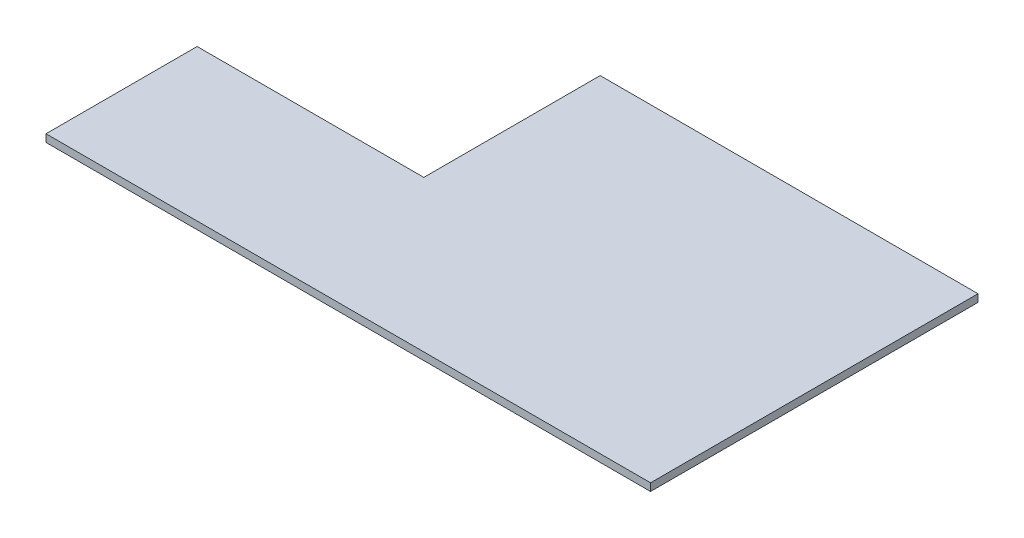
ISO-10303-21;
HEADER;
FILE_DESCRIPTION(('STEP AP214'),'2;1');
FILE_NAME('part.step','',(''),(''),'','','');
FILE_SCHEMA(('AUTOMOTIVE_DESIGN { 1 0 10303 214 1 1 1 1 }'));
ENDSEC;
DATA;
#1=APPLICATION_CONTEXT('core data for automotive mechanical design processes');
#2=APPLICATION_PROTOCOL_DEFINITION('international standard','automotive_design',2000,#1);
#3=PRODUCT_CONTEXT('',#1,'mechanical');
#4=PRODUCT('Part','Part','',(#3));
#5=PRODUCT_RELATED_PRODUCT_CATEGORY('part','',(#4));
#6=PRODUCT_DEFINITION_FORMATION('','',#4);
#7=PRODUCT_DEFINITION_CONTEXT('part definition',#1,'design');
#8=PRODUCT_DEFINITION('design','',#6,#7);
#9=PRODUCT_DEFINITION_SHAPE('','',#8);
#10=(LENGTH_UNIT() NAMED_UNIT(*) SI_UNIT(.MILLI.,.METRE.));
#11=(NAMED_UNIT(*) PLANE_ANGLE_UNIT() SI_UNIT($,.RADIAN.));
#12=(NAMED_UNIT(*) SI_UNIT($,.STERADIAN.) SOLID_ANGLE_UNIT());
#13=UNCERTAINTY_MEASURE_WITH_UNIT(LENGTH_MEASURE(1.E-05),#10,'distance_accuracy_value','');
#14=(GEOMETRIC_REPRESENTATION_CONTEXT(3) GLOBAL_UNCERTAINTY_ASSIGNED_CONTEXT((#13)) GLOBAL_UNIT_ASSIGNED_CONTEXT((#10,
#11,#12)) REPRESENTATION_CONTEXT('',''));
#15=CARTESIAN_POINT('',(0.,0.,0.));
#16=DIRECTION('',(0.,0.,1.));
#17=DIRECTION('',(1.,0.,0.));
#18=AXIS2_PLACEMENT_3D('',#15,#16,#17);
#19=CARTESIAN_POINT('',(120.,3.,-133.426061493411));
#20=DIRECTION('',(0.,0.,1.));
#21=DIRECTION('',(1.,0.,0.));
#22=AXIS2_PLACEMENT_3D('',#19,#20,#21);
#23=PLANE('',#22);
#24=DIRECTION('',(-1.,0.,0.));
#25=VECTOR('',#24,1.);
#26=CARTESIAN_POINT('',(120.,0.,-133.426061493411));
#27=LINE('',#26,#25);
#28=CARTESIAN_POINT('',(120.,0.,-133.426061493411));
#29=VERTEX_POINT('',#28);
#30=CARTESIAN_POINT('',(-30.,0.,-133.426061493411));
#31=VERTEX_POINT('',#30);
#32=EDGE_CURVE('E130',#29,#31,#27,.T.);
#33=ORIENTED_EDGE('',*,*,#32,.T.);
#34=DIRECTION('',(0.,-1.,0.));
#35=VECTOR('',#34,1.);
#36=CARTESIAN_POINT('',(-30.,3.,-133.426061493411));
#37=LINE('',#36,#35);
#38=CARTESIAN_POINT('',(-30.,3.,-133.426061493411));
#39=VERTEX_POINT('',#38);
#40=EDGE_CURVE('E46',#39,#31,#37,.T.);
#41=ORIENTED_EDGE('',*,*,#40,.F.);
#42=DIRECTION('',(-1.,0.,0.));
#43=VECTOR('',#42,1.);
#44=CARTESIAN_POINT('',(120.,3.,-133.426061493411));
#45=LINE('',#44,#43);
#46=CARTESIAN_POINT('',(120.,3.,-133.426061493411));
#47=VERTEX_POINT('',#46);
#48=EDGE_CURVE('E92',#47,#39,#45,.T.);
#49=ORIENTED_EDGE('',*,*,#48,.F.);
#50=DIRECTION('',(0.,-1.,0.));
#51=VECTOR('',#50,1.);
#52=CARTESIAN_POINT('',(120.,3.,-133.426061493411));
#53=LINE('',#52,#51);
#54=EDGE_CURVE('E11',#47,#29,#53,.T.);
#55=ORIENTED_EDGE('',*,*,#54,.T.);
#56=EDGE_LOOP('',(#33,#41,#49,#55));
#57=FACE_BOUND('',#56,.T.);
#58=ADVANCED_FACE('F37',(#57),#23,.F.);
#59=CARTESIAN_POINT('',(-30.,3.,-63.4260614934114));
#60=DIRECTION('',(1.,0.,0.));
#61=DIRECTION('',(0.,0.,-1.));
#62=AXIS2_PLACEMENT_3D('',#59,#60,#61);
#63=PLANE('',#62);
#64=DIRECTION('',(0.,0.,1.));
#65=VECTOR('',#64,1.);
#66=CARTESIAN_POINT('',(-30.,0.,-63.4260614934114));
#67=LINE('',#66,#65);
#68=CARTESIAN_POINT('',(-30.,0.,-63.4260614934114));
#69=VERTEX_POINT('',#68);
#70=EDGE_CURVE('E133',#31,#69,#67,.T.);
#71=ORIENTED_EDGE('',*,*,#70,.T.);
#72=DIRECTION('',(0.,-1.,0.));
#73=VECTOR('',#72,1.);
#74=CARTESIAN_POINT('',(-30.,3.,-63.4260614934114));
#75=LINE('',#74,#73);
#76=CARTESIAN_POINT('',(-30.,3.,-63.4260614934114));
#77=VERTEX_POINT('',#76);
#78=EDGE_CURVE('E117',#77,#69,#75,.T.);
#79=ORIENTED_EDGE('',*,*,#78,.F.);
#80=DIRECTION('',(0.,0.,1.));
#81=VECTOR('',#80,1.);
#82=CARTESIAN_POINT('',(-30.,3.,-63.4260614934114));
#83=LINE('',#82,#81);
#84=EDGE_CURVE('E106',#39,#77,#83,.T.);
#85=ORIENTED_EDGE('',*,*,#84,.F.);
#86=ORIENTED_EDGE('',*,*,#40,.T.);
#87=EDGE_LOOP('',(#71,#79,#85,#86));
#88=FACE_BOUND('',#87,.T.);
#89=ADVANCED_FACE('F154',(#88),#63,.F.);
#90=CARTESIAN_POINT('',(-120.,3.,-63.4260614934114));
#91=DIRECTION('',(0.,0.,1.));
#92=DIRECTION('',(1.,0.,0.));
#93=AXIS2_PLACEMENT_3D('',#90,#91,#92);
#94=PLANE('',#93);
#95=DIRECTION('',(-1.,0.,0.));
#96=VECTOR('',#95,1.);
#97=CARTESIAN_POINT('',(-120.,0.,-63.4260614934114));
#98=LINE('',#97,#96);
#99=CARTESIAN_POINT('',(-120.,0.,-63.4260614934114));
#100=VERTEX_POINT('',#99);
#101=EDGE_CURVE('E115',#69,#100,#98,.T.);
#102=ORIENTED_EDGE('',*,*,#101,.T.);
#103=DIRECTION('',(0.,-1.,0.));
#104=VECTOR('',#103,1.);
#105=CARTESIAN_POINT('',(-120.,3.,-63.4260614934114));
#106=LINE('',#105,#104);
#107=CARTESIAN_POINT('',(-120.,3.,-63.4260614934114));
#108=VERTEX_POINT('',#107);
#109=EDGE_CURVE('E112',#108,#100,#106,.T.);
#110=ORIENTED_EDGE('',*,*,#109,.F.);
#111=DIRECTION('',(-1.,0.,0.));
#112=VECTOR('',#111,1.);
#113=CARTESIAN_POINT('',(-120.,3.,-63.4260614934114));
#114=LINE('',#113,#112);
#115=EDGE_CURVE('E100',#77,#108,#114,.T.);
#116=ORIENTED_EDGE('',*,*,#115,.F.);
#117=ORIENTED_EDGE('',*,*,#78,.T.);
#118=EDGE_LOOP('',(#102,#110,#116,#117));
#119=FACE_BOUND('',#118,.T.);
#120=ADVANCED_FACE('F113',(#119),#94,.F.);
#121=CARTESIAN_POINT('',(-120.,3.,-3.42606149341143));
#122=DIRECTION('',(1.,0.,0.));
#123=DIRECTION('',(0.,0.,-1.));
#124=AXIS2_PLACEMENT_3D('',#121,#122,#123);
#125=PLANE('',#124);
#126=DIRECTION('',(0.,0.,1.));
#127=VECTOR('',#126,1.);
#128=CARTESIAN_POINT('',(-120.,0.,-3.42606149341143));
#129=LINE('',#128,#127);
#130=CARTESIAN_POINT('',(-120.,0.,-3.42606149341143));
#131=VERTEX_POINT('',#130);
#132=EDGE_CURVE('E78',#100,#131,#129,.T.);
#133=ORIENTED_EDGE('',*,*,#132,.T.);
#134=DIRECTION('',(0.,-1.,0.));
#135=VECTOR('',#134,1.);
#136=CARTESIAN_POINT('',(-120.,3.,-3.42606149341143));
#137=LINE('',#136,#135);
#138=CARTESIAN_POINT('',(-120.,3.,-3.42606149341143));
#139=VERTEX_POINT('',#138);
#140=EDGE_CURVE('E118',#139,#131,#137,.T.);
#141=ORIENTED_EDGE('',*,*,#140,.F.);
#142=DIRECTION('',(0.,0.,1.));
#143=VECTOR('',#142,1.);
#144=CARTESIAN_POINT('',(-120.,3.,-3.42606149341143));
#145=LINE('',#144,#143);
#146=EDGE_CURVE('E104',#108,#139,#145,.T.);
#147=ORIENTED_EDGE('',*,*,#146,.F.);
#148=ORIENTED_EDGE('',*,*,#109,.T.);
#149=EDGE_LOOP('',(#133,#141,#147,#148));
#150=FACE_BOUND('',#149,.T.);
#151=ADVANCED_FACE('F120',(#150),#125,.F.);
#152=CARTESIAN_POINT('',(-120.,3.,-3.42606149341143));
#153=DIRECTION('',(0.,0.,-1.));
#154=DIRECTION('',(-1.,0.,0.));
#155=AXIS2_PLACEMENT_3D('',#152,#153,#154);
#156=PLANE('',#155);
#157=DIRECTION('',(1.,0.,0.));
#158=VECTOR('',#157,1.);
#159=CARTESIAN_POINT('',(-120.,0.,-3.42606149341143));
#160=LINE('',#159,#158);
#161=CARTESIAN_POINT('',(120.,0.,-3.42606149341143));
#162=VERTEX_POINT('',#161);
#163=EDGE_CURVE('E85',#131,#162,#160,.T.);
#164=ORIENTED_EDGE('',*,*,#163,.T.);
#165=DIRECTION('',(0.,-1.,0.));
#166=VECTOR('',#165,1.);
#167=CARTESIAN_POINT('',(120.,3.,-3.42606149341143));
#168=LINE('',#167,#166);
#169=CARTESIAN_POINT('',(120.,3.,-3.42606149341143));
#170=VERTEX_POINT('',#169);
#171=EDGE_CURVE('E126',#170,#162,#168,.T.);
#172=ORIENTED_EDGE('',*,*,#171,.F.);
#173=DIRECTION('',(1.,0.,0.));
#174=VECTOR('',#173,1.);
#175=CARTESIAN_POINT('',(-120.,3.,-3.42606149341143));
#176=LINE('',#175,#174);
#177=EDGE_CURVE('E123',#139,#170,#176,.T.);
#178=ORIENTED_EDGE('',*,*,#177,.F.);
#179=ORIENTED_EDGE('',*,*,#140,.T.);
#180=EDGE_LOOP('',(#164,#172,#178,#179));
#181=FACE_BOUND('',#180,.T.);
#182=ADVANCED_FACE('F160',(#181),#156,.F.);
#183=CARTESIAN_POINT('',(120.,3.,-3.42606149341143));
#184=DIRECTION('',(-1.,0.,0.));
#185=DIRECTION('',(0.,0.,1.));
#186=AXIS2_PLACEMENT_3D('',#183,#184,#185);
#187=PLANE('',#186);
#188=DIRECTION('',(0.,0.,-1.));
#189=VECTOR('',#188,1.);
#190=CARTESIAN_POINT('',(120.,0.,-3.42606149341143));
#191=LINE('',#190,#189);
#192=EDGE_CURVE('E142',#162,#29,#191,.T.);
#193=ORIENTED_EDGE('',*,*,#192,.T.);
#194=ORIENTED_EDGE('',*,*,#54,.F.);
#195=DIRECTION('',(0.,0.,-1.));
#196=VECTOR('',#195,1.);
#197=CARTESIAN_POINT('',(120.,3.,-130.278184480234));
#198=LINE('',#197,#196);
#199=EDGE_CURVE('E54',#170,#47,#198,.T.);
#200=ORIENTED_EDGE('',*,*,#199,.F.);
#201=ORIENTED_EDGE('',*,*,#171,.T.);
#202=EDGE_LOOP('',(#193,#194,#200,#201));
#203=FACE_BOUND('',#202,.T.);
#204=ADVANCED_FACE('F159',(#203),#187,.F.);
#205=CARTESIAN_POINT('',(0.,3.,0.));
#206=DIRECTION('',(0.,1.,0.));
#207=DIRECTION('',(0.,0.,1.));
#208=AXIS2_PLACEMENT_3D('',#205,#206,#207);
#209=PLANE('',#208);
#210=ORIENTED_EDGE('',*,*,#199,.T.);
#211=ORIENTED_EDGE('',*,*,#48,.T.);
#212=ORIENTED_EDGE('',*,*,#84,.T.);
#213=ORIENTED_EDGE('',*,*,#115,.T.);
#214=ORIENTED_EDGE('',*,*,#146,.T.);
#215=ORIENTED_EDGE('',*,*,#177,.T.);
#216=EDGE_LOOP('',(#210,#211,#212,#213,#214,#215));
#217=FACE_BOUND('',#216,.T.);
#218=ADVANCED_FACE('F102',(#217),#209,.T.);
#219=CARTESIAN_POINT('',(0.,0.,0.));
#220=DIRECTION('',(0.,1.,0.));
#221=DIRECTION('',(0.,0.,1.));
#222=AXIS2_PLACEMENT_3D('',#219,#220,#221);
#223=PLANE('',#222);
#224=ORIENTED_EDGE('',*,*,#32,.F.);
#225=ORIENTED_EDGE('',*,*,#192,.F.);
#226=ORIENTED_EDGE('',*,*,#163,.F.);
#227=ORIENTED_EDGE('',*,*,#132,.F.);
#228=ORIENTED_EDGE('',*,*,#101,.F.);
#229=ORIENTED_EDGE('',*,*,#70,.F.);
#230=EDGE_LOOP('',(#224,#225,#226,#227,#228,#229));
#231=FACE_BOUND('',#230,.T.);
#232=ADVANCED_FACE('F157',(#231),#223,.F.);
#233=CLOSED_SHELL('',(#58,#89,#120,#151,#182,#204,#218,#232));
#234=MANIFOLD_SOLID_BREP('B2',#233);
#235=ADVANCED_BREP_SHAPE_REPRESENTATION('',(#18,#234),#14);
#236=SHAPE_DEFINITION_REPRESENTATION(#9,#235);
ENDSEC;
END-ISO-10303-21;
